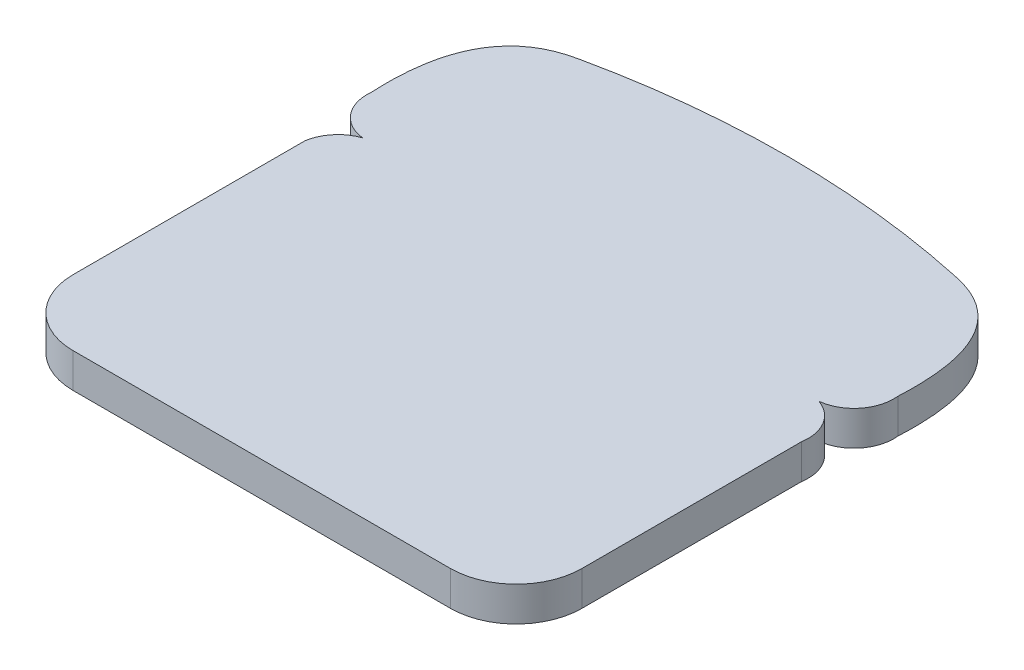
ISO-10303-21;
HEADER;
FILE_DESCRIPTION(('STEP AP214'),'2;1');
FILE_NAME('part.step','',(''),(''),'','','');
FILE_SCHEMA(('AUTOMOTIVE_DESIGN { 1 0 10303 214 1 1 1 1 }'));
ENDSEC;
DATA;
#1=APPLICATION_CONTEXT('core data for automotive mechanical design processes');
#2=APPLICATION_PROTOCOL_DEFINITION('international standard','automotive_design',2000,#1);
#3=PRODUCT_CONTEXT('',#1,'mechanical');
#4=PRODUCT('Part','Part','',(#3));
#5=PRODUCT_RELATED_PRODUCT_CATEGORY('part','',(#4));
#6=PRODUCT_DEFINITION_FORMATION('','',#4);
#7=PRODUCT_DEFINITION_CONTEXT('part definition',#1,'design');
#8=PRODUCT_DEFINITION('design','',#6,#7);
#9=PRODUCT_DEFINITION_SHAPE('','',#8);
#10=(LENGTH_UNIT() NAMED_UNIT(*) SI_UNIT(.MILLI.,.METRE.));
#11=(NAMED_UNIT(*) PLANE_ANGLE_UNIT() SI_UNIT($,.RADIAN.));
#12=(NAMED_UNIT(*) SI_UNIT($,.STERADIAN.) SOLID_ANGLE_UNIT());
#13=UNCERTAINTY_MEASURE_WITH_UNIT(LENGTH_MEASURE(1.E-05),#10,'distance_accuracy_value','');
#14=(GEOMETRIC_REPRESENTATION_CONTEXT(3) GLOBAL_UNCERTAINTY_ASSIGNED_CONTEXT((#13)) GLOBAL_UNIT_ASSIGNED_CONTEXT((#10,
#11,#12)) REPRESENTATION_CONTEXT('',''));
#15=CARTESIAN_POINT('',(0.,0.,0.));
#16=DIRECTION('',(0.,0.,1.));
#17=DIRECTION('',(1.,0.,0.));
#18=AXIS2_PLACEMENT_3D('',#15,#16,#17);
#19=CARTESIAN_POINT('',(62.3050757225177,10.,-11.3480454335106));
#20=DIRECTION('',(0.,-1.,0.));
#21=DIRECTION('',(0.,0.,-1.));
#22=AXIS2_PLACEMENT_3D('',#19,#20,#21);
#23=CYLINDRICAL_SURFACE('',#22,11.5003391254346);
#24=CARTESIAN_POINT('',(62.3050757225177,0.,-11.3480454335106));
#25=DIRECTION('',(0.,1.,0.));
#26=DIRECTION('',(0.,0.,1.));
#27=AXIS2_PLACEMENT_3D('',#24,#25,#26);
#28=CIRCLE('',#27,11.5003391254346);
#29=CARTESIAN_POINT('',(73.66,0.,-9.525));
#30=VERTEX_POINT('',#29);
#31=CARTESIAN_POINT('',(66.04,0.,-22.225));
#32=VERTEX_POINT('',#31);
#33=EDGE_CURVE('E154',#30,#32,#28,.T.);
#34=ORIENTED_EDGE('',*,*,#33,.T.);
#35=DIRECTION('',(0.,-1.,0.));
#36=VECTOR('',#35,1.);
#37=CARTESIAN_POINT('',(66.04,10.,-22.225));
#38=LINE('',#37,#36);
#39=CARTESIAN_POINT('',(66.04,10.,-22.225));
#40=VERTEX_POINT('',#39);
#41=EDGE_CURVE('E11',#40,#32,#38,.T.);
#42=ORIENTED_EDGE('',*,*,#41,.F.);
#43=CARTESIAN_POINT('',(62.3050757225177,10.,-11.3480454335106));
#44=DIRECTION('',(0.,1.,0.));
#45=DIRECTION('',(0.,0.,1.));
#46=AXIS2_PLACEMENT_3D('',#43,#44,#45);
#47=CIRCLE('',#46,11.5003391254346);
#48=CARTESIAN_POINT('',(73.66,10.,-9.525));
#49=VERTEX_POINT('',#48);
#50=EDGE_CURVE('E193',#49,#40,#47,.T.);
#51=ORIENTED_EDGE('',*,*,#50,.F.);
#52=DIRECTION('',(0.,-1.,0.));
#53=VECTOR('',#52,1.);
#54=CARTESIAN_POINT('',(73.66,10.,-9.525));
#55=LINE('',#54,#53);
#56=EDGE_CURVE('E150',#49,#30,#55,.T.);
#57=ORIENTED_EDGE('',*,*,#56,.T.);
#58=EDGE_LOOP('',(#34,#42,#51,#57));
#59=FACE_BOUND('',#58,.T.);
#60=ADVANCED_FACE('F35',(#59),#23,.T.);
#61=CARTESIAN_POINT('',(64.77,10.,-33.655));
#62=DIRECTION('',(0.,-1.,0.));
#63=DIRECTION('',(0.,0.,-1.));
#64=AXIS2_PLACEMENT_3D('',#61,#62,#63);
#65=CYLINDRICAL_SURFACE('',#64,11.5003391254346);
#66=CARTESIAN_POINT('',(64.77,0.,-33.655));
#67=DIRECTION('',(0.,1.,0.));
#68=DIRECTION('',(0.,0.,1.));
#69=AXIS2_PLACEMENT_3D('',#66,#67,#68);
#70=CIRCLE('',#69,11.5003391254346);
#71=CARTESIAN_POINT('',(76.2,0.,-34.925));
#72=VERTEX_POINT('',#71);
#73=EDGE_CURVE('E157',#32,#72,#70,.T.);
#74=ORIENTED_EDGE('',*,*,#73,.T.);
#75=DIRECTION('',(0.,-1.,0.));
#76=VECTOR('',#75,1.);
#77=CARTESIAN_POINT('',(76.2,10.,-34.925));
#78=LINE('',#77,#76);
#79=CARTESIAN_POINT('',(76.2,10.,-34.925));
#80=VERTEX_POINT('',#79);
#81=EDGE_CURVE('E43',#80,#72,#78,.T.);
#82=ORIENTED_EDGE('',*,*,#81,.F.);
#83=CARTESIAN_POINT('',(64.77,10.,-33.655));
#84=DIRECTION('',(0.,1.,0.));
#85=DIRECTION('',(0.,0.,1.));
#86=AXIS2_PLACEMENT_3D('',#83,#84,#85);
#87=CIRCLE('',#86,11.5003391254346);
#88=EDGE_CURVE('E102',#40,#80,#87,.T.);
#89=ORIENTED_EDGE('',*,*,#88,.F.);
#90=ORIENTED_EDGE('',*,*,#41,.T.);
#91=EDGE_LOOP('',(#74,#82,#89,#90));
#92=FACE_BOUND('',#91,.T.);
#93=ADVANCED_FACE('F215',(#92),#65,.T.);
#94=CARTESIAN_POINT('',(54.2615413195234,10.,-73.3340623459974));
#95=CARTESIAN_POINT('',(78.0336613834573,10.,-68.7720922290549));
#96=CARTESIAN_POINT('',(76.2,10.,-34.925));
#97=B_SPLINE_CURVE_WITH_KNOTS('',2,(#94,#95,#96),.UNSPECIFIED.,.F.,.F.,(3,3),(0.,1.),.UNSPECIFIED.);
#98=DIRECTION('',(0.,-1.,0.));
#99=VECTOR('',#98,1.);
#100=SURFACE_OF_LINEAR_EXTRUSION('',#97,#99);
#101=CARTESIAN_POINT('',(54.2615413195234,0.,-73.3340623459974));
#102=CARTESIAN_POINT('',(78.0336613834573,0.,-68.7720922290549));
#103=CARTESIAN_POINT('',(76.2,0.,-34.925));
#104=B_SPLINE_CURVE_WITH_KNOTS('',2,(#101,#102,#103),.UNSPECIFIED.,.F.,.F.,(3,3),(0.,1.),.UNSPECIFIED.);
#105=CARTESIAN_POINT('',(54.2615413195234,0.,-73.3340623459974));
#106=VERTEX_POINT('',#105);
#107=EDGE_CURVE('E160',#106,#72,#104,.T.);
#108=ORIENTED_EDGE('',*,*,#107,.F.);
#109=DIRECTION('',(0.,-1.,0.));
#110=VECTOR('',#109,1.);
#111=CARTESIAN_POINT('',(54.2615413195234,10.,-73.3340623459974));
#112=LINE('',#111,#110);
#113=CARTESIAN_POINT('',(54.2615413195234,10.,-73.3340623459974));
#114=VERTEX_POINT('',#113);
#115=EDGE_CURVE('E208',#114,#106,#112,.T.);
#116=ORIENTED_EDGE('',*,*,#115,.F.);
#117=EDGE_CURVE('E214',#114,#80,#97,.T.);
#118=ORIENTED_EDGE('',*,*,#117,.T.);
#119=ORIENTED_EDGE('',*,*,#81,.T.);
#120=EDGE_LOOP('',(#108,#116,#118,#119));
#121=FACE_BOUND('',#120,.T.);
#122=ADVANCED_FACE('F212',(#121),#100,.T.);
#123=CARTESIAN_POINT('',(0.,10.,178.220883433946));
#124=DIRECTION('',(0.,-1.,0.));
#125=DIRECTION('',(0.,0.,-1.));
#126=AXIS2_PLACEMENT_3D('',#123,#124,#125);
#127=CYLINDRICAL_SURFACE('',#126,257.340641199016);
#128=CARTESIAN_POINT('',(0.,0.,178.220883433946));
#129=DIRECTION('',(0.,1.,0.));
#130=DIRECTION('',(0.,0.,1.));
#131=AXIS2_PLACEMENT_3D('',#128,#129,#130);
#132=CIRCLE('',#131,257.340641199016);
#133=CARTESIAN_POINT('',(-54.2615413195235,0.,-73.3340623459974));
#134=VERTEX_POINT('',#133);
#135=EDGE_CURVE('E165',#134,#106,#132,.F.);
#136=ORIENTED_EDGE('',*,*,#135,.F.);
#137=DIRECTION('',(0.,-1.,0.));
#138=VECTOR('',#137,1.);
#139=CARTESIAN_POINT('',(-54.2615413195235,10.,-73.3340623459974));
#140=LINE('',#139,#138);
#141=CARTESIAN_POINT('',(-54.2615413195235,10.,-73.3340623459974));
#142=VERTEX_POINT('',#141);
#143=EDGE_CURVE('E206',#142,#134,#140,.T.);
#144=ORIENTED_EDGE('',*,*,#143,.F.);
#145=CARTESIAN_POINT('',(0.,10.,178.220883433946));
#146=DIRECTION('',(0.,1.,0.));
#147=DIRECTION('',(0.,0.,1.));
#148=AXIS2_PLACEMENT_3D('',#145,#146,#147);
#149=CIRCLE('',#148,257.340641199016);
#150=EDGE_CURVE('E227',#142,#114,#149,.F.);
#151=ORIENTED_EDGE('',*,*,#150,.T.);
#152=ORIENTED_EDGE('',*,*,#115,.T.);
#153=EDGE_LOOP('',(#136,#144,#151,#152));
#154=FACE_BOUND('',#153,.T.);
#155=ADVANCED_FACE('F223',(#154),#127,.T.);
#156=CARTESIAN_POINT('',(-54.2615413195234,10.,-73.3340623459974));
#157=CARTESIAN_POINT('',(-78.0336613834573,10.,-68.772092229055));
#158=CARTESIAN_POINT('',(-76.2,10.,-34.925));
#159=B_SPLINE_CURVE_WITH_KNOTS('',2,(#156,#157,#158),.UNSPECIFIED.,.F.,.F.,(3,3),(0.,1.),.UNSPECIFIED.);
#160=DIRECTION('',(0.,-1.,0.));
#161=VECTOR('',#160,1.);
#162=SURFACE_OF_LINEAR_EXTRUSION('',#159,#161);
#163=CARTESIAN_POINT('',(-54.2615413195234,0.,-73.3340623459974));
#164=CARTESIAN_POINT('',(-78.0336613834573,0.,-68.772092229055));
#165=CARTESIAN_POINT('',(-76.2,0.,-34.925));
#166=B_SPLINE_CURVE_WITH_KNOTS('',2,(#163,#164,#165),.UNSPECIFIED.,.F.,.F.,(3,3),(0.,1.),.UNSPECIFIED.);
#167=CARTESIAN_POINT('',(-76.2,0.,-34.925));
#168=VERTEX_POINT('',#167);
#169=EDGE_CURVE('E171',#134,#168,#166,.T.);
#170=ORIENTED_EDGE('',*,*,#169,.T.);
#171=DIRECTION('',(0.,-1.,0.));
#172=VECTOR('',#171,1.);
#173=CARTESIAN_POINT('',(-76.2,10.,-34.925));
#174=LINE('',#173,#172);
#175=CARTESIAN_POINT('',(-76.2,10.,-34.925));
#176=VERTEX_POINT('',#175);
#177=EDGE_CURVE('E204',#176,#168,#174,.T.);
#178=ORIENTED_EDGE('',*,*,#177,.F.);
#179=EDGE_CURVE('E229',#142,#176,#159,.T.);
#180=ORIENTED_EDGE('',*,*,#179,.F.);
#181=ORIENTED_EDGE('',*,*,#143,.T.);
#182=EDGE_LOOP('',(#170,#178,#180,#181));
#183=FACE_BOUND('',#182,.T.);
#184=ADVANCED_FACE('F275',(#183),#162,.F.);
#185=CARTESIAN_POINT('',(-64.77,10.,-33.655));
#186=DIRECTION('',(0.,-1.,0.));
#187=DIRECTION('',(0.,0.,-1.));
#188=AXIS2_PLACEMENT_3D('',#185,#186,#187);
#189=CYLINDRICAL_SURFACE('',#188,11.5003391254345);
#190=CARTESIAN_POINT('',(-64.77,0.,-33.655));
#191=DIRECTION('',(0.,1.,0.));
#192=DIRECTION('',(0.,0.,1.));
#193=AXIS2_PLACEMENT_3D('',#190,#191,#192);
#194=CIRCLE('',#193,11.5003391254345);
#195=CARTESIAN_POINT('',(-66.04,0.,-22.225));
#196=VERTEX_POINT('',#195);
#197=EDGE_CURVE('E176',#196,#168,#194,.F.);
#198=ORIENTED_EDGE('',*,*,#197,.F.);
#199=DIRECTION('',(0.,-1.,0.));
#200=VECTOR('',#199,1.);
#201=CARTESIAN_POINT('',(-66.04,10.,-22.225));
#202=LINE('',#201,#200);
#203=CARTESIAN_POINT('',(-66.04,10.,-22.225));
#204=VERTEX_POINT('',#203);
#205=EDGE_CURVE('E202',#204,#196,#202,.T.);
#206=ORIENTED_EDGE('',*,*,#205,.F.);
#207=CARTESIAN_POINT('',(-64.77,10.,-33.655));
#208=DIRECTION('',(0.,1.,0.));
#209=DIRECTION('',(0.,0.,1.));
#210=AXIS2_PLACEMENT_3D('',#207,#208,#209);
#211=CIRCLE('',#210,11.5003391254345);
#212=EDGE_CURVE('E273',#204,#176,#211,.F.);
#213=ORIENTED_EDGE('',*,*,#212,.T.);
#214=ORIENTED_EDGE('',*,*,#177,.T.);
#215=EDGE_LOOP('',(#198,#206,#213,#214));
#216=FACE_BOUND('',#215,.T.);
#217=ADVANCED_FACE('F269',(#216),#189,.T.);
#218=CARTESIAN_POINT('',(-62.3050757225177,10.,-11.3480454335106));
#219=DIRECTION('',(0.,-1.,0.));
#220=DIRECTION('',(0.,0.,-1.));
#221=AXIS2_PLACEMENT_3D('',#218,#219,#220);
#222=CYLINDRICAL_SURFACE('',#221,11.5003391254345);
#223=CARTESIAN_POINT('',(-62.3050757225177,0.,-11.3480454335106));
#224=DIRECTION('',(0.,1.,0.));
#225=DIRECTION('',(0.,0.,1.));
#226=AXIS2_PLACEMENT_3D('',#223,#224,#225);
#227=CIRCLE('',#226,11.5003391254345);
#228=CARTESIAN_POINT('',(-73.66,0.,-13.1710908670212));
#229=VERTEX_POINT('',#228);
#230=EDGE_CURVE('E182',#229,#196,#227,.F.);
#231=ORIENTED_EDGE('',*,*,#230,.F.);
#232=DIRECTION('',(0.,-1.,0.));
#233=VECTOR('',#232,1.);
#234=CARTESIAN_POINT('',(-73.66,10.,-13.1710908670212));
#235=LINE('',#234,#233);
#236=CARTESIAN_POINT('',(-73.66,10.,-13.1710908670212));
#237=VERTEX_POINT('',#236);
#238=EDGE_CURVE('E200',#237,#229,#235,.T.);
#239=ORIENTED_EDGE('',*,*,#238,.F.);
#240=CARTESIAN_POINT('',(-62.3050757225177,10.,-11.3480454335106));
#241=DIRECTION('',(0.,1.,0.));
#242=DIRECTION('',(0.,0.,1.));
#243=AXIS2_PLACEMENT_3D('',#240,#241,#242);
#244=CIRCLE('',#243,11.5003391254345);
#245=EDGE_CURVE('E266',#237,#204,#244,.F.);
#246=ORIENTED_EDGE('',*,*,#245,.T.);
#247=ORIENTED_EDGE('',*,*,#205,.T.);
#248=EDGE_LOOP('',(#231,#239,#246,#247));
#249=FACE_BOUND('',#248,.T.);
#250=ADVANCED_FACE('F265',(#249),#222,.T.);
#251=CARTESIAN_POINT('',(-73.66,10.,-15.1398708228043));
#252=DIRECTION('',(1.,0.,0.));
#253=DIRECTION('',(0.,0.,-1.));
#254=AXIS2_PLACEMENT_3D('',#251,#252,#253);
#255=PLANE('',#254);
#256=DIRECTION('',(0.,0.,1.));
#257=VECTOR('',#256,1.);
#258=CARTESIAN_POINT('',(-73.66,0.,-15.1398708228043));
#259=LINE('',#258,#257);
#260=CARTESIAN_POINT('',(-73.66,0.,53.975));
#261=VERTEX_POINT('',#260);
#262=EDGE_CURVE('E185',#229,#261,#259,.T.);
#263=ORIENTED_EDGE('',*,*,#262,.T.);
#264=DIRECTION('',(0.,-1.,0.));
#265=VECTOR('',#264,1.);
#266=CARTESIAN_POINT('',(-73.66,10.,53.975));
#267=LINE('',#266,#265);
#268=CARTESIAN_POINT('',(-73.66,10.,53.975));
#269=VERTEX_POINT('',#268);
#270=EDGE_CURVE('E197',#269,#261,#267,.T.);
#271=ORIENTED_EDGE('',*,*,#270,.F.);
#272=DIRECTION('',(0.,0.,1.));
#273=VECTOR('',#272,1.);
#274=CARTESIAN_POINT('',(-73.66,10.,-15.1398708228043));
#275=LINE('',#274,#273);
#276=EDGE_CURVE('E261',#237,#269,#275,.T.);
#277=ORIENTED_EDGE('',*,*,#276,.F.);
#278=ORIENTED_EDGE('',*,*,#238,.T.);
#279=EDGE_LOOP('',(#263,#271,#277,#278));
#280=FACE_BOUND('',#279,.T.);
#281=ADVANCED_FACE('F260',(#280),#255,.F.);
#282=CARTESIAN_POINT('',(-54.61,10.,53.975));
#283=DIRECTION('',(0.,-1.,0.));
#284=DIRECTION('',(0.,0.,-1.));
#285=AXIS2_PLACEMENT_3D('',#282,#283,#284);
#286=CYLINDRICAL_SURFACE('',#285,19.05);
#287=CARTESIAN_POINT('',(-54.61,0.,53.975));
#288=DIRECTION('',(0.,1.,0.));
#289=DIRECTION('',(0.,0.,1.));
#290=AXIS2_PLACEMENT_3D('',#287,#288,#289);
#291=CIRCLE('',#290,19.05);
#292=CARTESIAN_POINT('',(-54.61,0.,73.025));
#293=VERTEX_POINT('',#292);
#294=EDGE_CURVE('E187',#261,#293,#291,.T.);
#295=ORIENTED_EDGE('',*,*,#294,.T.);
#296=DIRECTION('',(0.,-1.,0.));
#297=VECTOR('',#296,1.);
#298=CARTESIAN_POINT('',(-54.61,10.,73.025));
#299=LINE('',#298,#297);
#300=CARTESIAN_POINT('',(-54.61,10.,73.025));
#301=VERTEX_POINT('',#300);
#302=EDGE_CURVE('E146',#301,#293,#299,.T.);
#303=ORIENTED_EDGE('',*,*,#302,.F.);
#304=CARTESIAN_POINT('',(-54.61,10.,53.975));
#305=DIRECTION('',(0.,1.,0.));
#306=DIRECTION('',(0.,0.,1.));
#307=AXIS2_PLACEMENT_3D('',#304,#305,#306);
#308=CIRCLE('',#307,19.05);
#309=EDGE_CURVE('E133',#269,#301,#308,.T.);
#310=ORIENTED_EDGE('',*,*,#309,.F.);
#311=ORIENTED_EDGE('',*,*,#270,.T.);
#312=EDGE_LOOP('',(#295,#303,#310,#311));
#313=FACE_BOUND('',#312,.T.);
#314=ADVANCED_FACE('F256',(#313),#286,.T.);
#315=CARTESIAN_POINT('',(-201.925131761872,10.,73.025));
#316=DIRECTION('',(0.,0.,-1.));
#317=DIRECTION('',(-1.,0.,0.));
#318=AXIS2_PLACEMENT_3D('',#315,#316,#317);
#319=PLANE('',#318);
#320=DIRECTION('',(1.,0.,0.));
#321=VECTOR('',#320,1.);
#322=CARTESIAN_POINT('',(-201.925131761872,0.,73.025));
#323=LINE('',#322,#321);
#324=CARTESIAN_POINT('',(54.61,0.,73.025));
#325=VERTEX_POINT('',#324);
#326=EDGE_CURVE('E142',#293,#325,#323,.T.);
#327=ORIENTED_EDGE('',*,*,#326,.T.);
#328=DIRECTION('',(0.,-1.,0.));
#329=VECTOR('',#328,1.);
#330=CARTESIAN_POINT('',(54.61,10.,73.025));
#331=LINE('',#330,#329);
#332=CARTESIAN_POINT('',(54.61,10.,73.025));
#333=VERTEX_POINT('',#332);
#334=EDGE_CURVE('E139',#333,#325,#331,.T.);
#335=ORIENTED_EDGE('',*,*,#334,.F.);
#336=DIRECTION('',(1.,0.,0.));
#337=VECTOR('',#336,1.);
#338=CARTESIAN_POINT('',(-201.925131761872,10.,73.025));
#339=LINE('',#338,#337);
#340=EDGE_CURVE('E127',#301,#333,#339,.T.);
#341=ORIENTED_EDGE('',*,*,#340,.F.);
#342=ORIENTED_EDGE('',*,*,#302,.T.);
#343=EDGE_LOOP('',(#327,#335,#341,#342));
#344=FACE_BOUND('',#343,.T.);
#345=ADVANCED_FACE('F140',(#344),#319,.F.);
#346=CARTESIAN_POINT('',(54.61,10.,53.975));
#347=DIRECTION('',(0.,-1.,0.));
#348=DIRECTION('',(0.,0.,-1.));
#349=AXIS2_PLACEMENT_3D('',#346,#347,#348);
#350=CYLINDRICAL_SURFACE('',#349,19.05);
#351=CARTESIAN_POINT('',(54.61,0.,53.975));
#352=DIRECTION('',(0.,1.,0.));
#353=DIRECTION('',(0.,0.,1.));
#354=AXIS2_PLACEMENT_3D('',#351,#352,#353);
#355=CIRCLE('',#354,19.05);
#356=CARTESIAN_POINT('',(73.66,0.,53.975));
#357=VERTEX_POINT('',#356);
#358=EDGE_CURVE('E190',#357,#325,#355,.F.);
#359=ORIENTED_EDGE('',*,*,#358,.F.);
#360=DIRECTION('',(0.,-1.,0.));
#361=VECTOR('',#360,1.);
#362=CARTESIAN_POINT('',(73.66,10.,53.975));
#363=LINE('',#362,#361);
#364=CARTESIAN_POINT('',(73.66,10.,53.975));
#365=VERTEX_POINT('',#364);
#366=EDGE_CURVE('E91',#365,#357,#363,.T.);
#367=ORIENTED_EDGE('',*,*,#366,.F.);
#368=CARTESIAN_POINT('',(54.61,10.,53.975));
#369=DIRECTION('',(0.,1.,0.));
#370=DIRECTION('',(0.,0.,1.));
#371=AXIS2_PLACEMENT_3D('',#368,#369,#370);
#372=CIRCLE('',#371,19.05);
#373=EDGE_CURVE('E131',#365,#333,#372,.F.);
#374=ORIENTED_EDGE('',*,*,#373,.T.);
#375=ORIENTED_EDGE('',*,*,#334,.T.);
#376=EDGE_LOOP('',(#359,#367,#374,#375));
#377=FACE_BOUND('',#376,.T.);
#378=ADVANCED_FACE('F148',(#377),#350,.T.);
#379=CARTESIAN_POINT('',(73.66,10.,-15.1398708228043));
#380=DIRECTION('',(-1.,0.,0.));
#381=DIRECTION('',(0.,0.,1.));
#382=AXIS2_PLACEMENT_3D('',#379,#380,#381);
#383=PLANE('',#382);
#384=DIRECTION('',(0.,0.,-1.));
#385=VECTOR('',#384,1.);
#386=CARTESIAN_POINT('',(73.66,0.,-15.1398708228043));
#387=LINE('',#386,#385);
#388=EDGE_CURVE('E94',#357,#30,#387,.T.);
#389=ORIENTED_EDGE('',*,*,#388,.T.);
#390=ORIENTED_EDGE('',*,*,#56,.F.);
#391=DIRECTION('',(0.,0.,-1.));
#392=VECTOR('',#391,1.);
#393=CARTESIAN_POINT('',(73.66,10.,-15.1398708228043));
#394=LINE('',#393,#392);
#395=EDGE_CURVE('E51',#365,#49,#394,.T.);
#396=ORIENTED_EDGE('',*,*,#395,.F.);
#397=ORIENTED_EDGE('',*,*,#366,.T.);
#398=EDGE_LOOP('',(#389,#390,#396,#397));
#399=FACE_BOUND('',#398,.T.);
#400=ADVANCED_FACE('F298',(#399),#383,.F.);
#401=CARTESIAN_POINT('',(-201.925131761872,10.,-15.1398708228043));
#402=DIRECTION('',(0.,1.,0.));
#403=DIRECTION('',(0.,0.,1.));
#404=AXIS2_PLACEMENT_3D('',#401,#402,#403);
#405=PLANE('',#404);
#406=ORIENTED_EDGE('',*,*,#50,.T.);
#407=ORIENTED_EDGE('',*,*,#88,.T.);
#408=ORIENTED_EDGE('',*,*,#117,.F.);
#409=ORIENTED_EDGE('',*,*,#150,.F.);
#410=ORIENTED_EDGE('',*,*,#179,.T.);
#411=ORIENTED_EDGE('',*,*,#212,.F.);
#412=ORIENTED_EDGE('',*,*,#245,.F.);
#413=ORIENTED_EDGE('',*,*,#276,.T.);
#414=ORIENTED_EDGE('',*,*,#309,.T.);
#415=ORIENTED_EDGE('',*,*,#340,.T.);
#416=ORIENTED_EDGE('',*,*,#373,.F.);
#417=ORIENTED_EDGE('',*,*,#395,.T.);
#418=EDGE_LOOP('',(#406,#407,#408,#409,#410,#411,#412,#413,#414,#415,#416,#417));
#419=FACE_BOUND('',#418,.T.);
#420=ADVANCED_FACE('F129',(#419),#405,.T.);
#421=CARTESIAN_POINT('',(-201.925131761872,0.,-15.1398708228043));
#422=DIRECTION('',(0.,1.,0.));
#423=DIRECTION('',(0.,0.,1.));
#424=AXIS2_PLACEMENT_3D('',#421,#422,#423);
#425=PLANE('',#424);
#426=ORIENTED_EDGE('',*,*,#33,.F.);
#427=ORIENTED_EDGE('',*,*,#388,.F.);
#428=ORIENTED_EDGE('',*,*,#358,.T.);
#429=ORIENTED_EDGE('',*,*,#326,.F.);
#430=ORIENTED_EDGE('',*,*,#294,.F.);
#431=ORIENTED_EDGE('',*,*,#262,.F.);
#432=ORIENTED_EDGE('',*,*,#230,.T.);
#433=ORIENTED_EDGE('',*,*,#197,.T.);
#434=ORIENTED_EDGE('',*,*,#169,.F.);
#435=ORIENTED_EDGE('',*,*,#135,.T.);
#436=ORIENTED_EDGE('',*,*,#107,.T.);
#437=ORIENTED_EDGE('',*,*,#73,.F.);
#438=EDGE_LOOP('',(#426,#427,#428,#429,#430,#431,#432,#433,#434,#435,#436,#437));
#439=FACE_BOUND('',#438,.T.);
#440=ADVANCED_FACE('F219',(#439),#425,.F.);
#441=CLOSED_SHELL('',(#60,#93,#122,#155,#184,#217,#250,#281,#314,#345,#378,#400,#420,#440));
#442=MANIFOLD_SOLID_BREP('B2',#441);
#443=ADVANCED_BREP_SHAPE_REPRESENTATION('',(#18,#442),#14);
#444=SHAPE_DEFINITION_REPRESENTATION(#9,#443);
ENDSEC;
END-ISO-10303-21;
